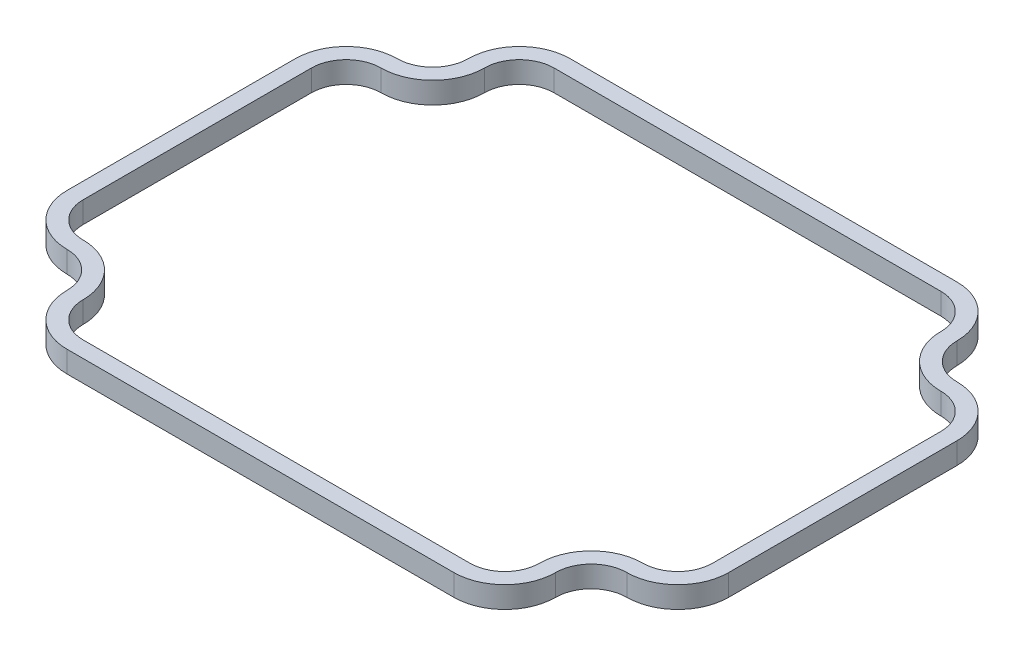
ISO-10303-21;
HEADER;
FILE_DESCRIPTION(('STEP AP214'),'2;1');
FILE_NAME('part.step','',(''),(''),'','','');
FILE_SCHEMA(('AUTOMOTIVE_DESIGN { 1 0 10303 214 1 1 1 1 }'));
ENDSEC;
DATA;
#1=APPLICATION_CONTEXT('core data for automotive mechanical design processes');
#2=APPLICATION_PROTOCOL_DEFINITION('international standard','automotive_design',2000,#1);
#3=PRODUCT_CONTEXT('',#1,'mechanical');
#4=PRODUCT('Part','Part','',(#3));
#5=PRODUCT_RELATED_PRODUCT_CATEGORY('part','',(#4));
#6=PRODUCT_DEFINITION_FORMATION('','',#4);
#7=PRODUCT_DEFINITION_CONTEXT('part definition',#1,'design');
#8=PRODUCT_DEFINITION('design','',#6,#7);
#9=PRODUCT_DEFINITION_SHAPE('','',#8);
#10=(LENGTH_UNIT() NAMED_UNIT(*) SI_UNIT(.MILLI.,.METRE.));
#11=(NAMED_UNIT(*) PLANE_ANGLE_UNIT() SI_UNIT($,.RADIAN.));
#12=(NAMED_UNIT(*) SI_UNIT($,.STERADIAN.) SOLID_ANGLE_UNIT());
#13=UNCERTAINTY_MEASURE_WITH_UNIT(LENGTH_MEASURE(1.E-05),#10,'distance_accuracy_value','');
#14=(GEOMETRIC_REPRESENTATION_CONTEXT(3) GLOBAL_UNCERTAINTY_ASSIGNED_CONTEXT((#13)) GLOBAL_UNIT_ASSIGNED_CONTEXT((#10,
#11,#12)) REPRESENTATION_CONTEXT('',''));
#15=CARTESIAN_POINT('',(0.,0.,0.));
#16=DIRECTION('',(0.,0.,1.));
#17=DIRECTION('',(1.,0.,0.));
#18=AXIS2_PLACEMENT_3D('',#15,#16,#17);
#19=CARTESIAN_POINT('',(-26.4668,0.,10.795));
#20=DIRECTION('',(0.,-1.,0.));
#21=DIRECTION('',(0.,0.,-1.));
#22=AXIS2_PLACEMENT_3D('',#19,#20,#21);
#23=CYLINDRICAL_SURFACE('',#22,4.8133);
#24=DIRECTION('',(0.,-1.,0.));
#25=VECTOR('',#24,1.);
#26=CARTESIAN_POINT('',(-26.4668,0.,15.6083));
#27=LINE('',#26,#25);
#28=CARTESIAN_POINT('',(-26.4668,2.032,15.6083));
#29=VERTEX_POINT('',#28);
#30=CARTESIAN_POINT('',(-26.4668,0.,15.6083));
#31=VERTEX_POINT('',#30);
#32=EDGE_CURVE('E485',#29,#31,#27,.T.);
#33=ORIENTED_EDGE('',*,*,#32,.F.);
#34=CARTESIAN_POINT('',(-26.4668,2.032,10.795));
#35=DIRECTION('',(0.,-1.,0.));
#36=DIRECTION('',(0.,0.,-1.));
#37=AXIS2_PLACEMENT_3D('',#34,#35,#36);
#38=CIRCLE('',#37,4.8133);
#39=CARTESIAN_POINT('',(-31.2801,2.032,10.795));
#40=VERTEX_POINT('',#39);
#41=EDGE_CURVE('E504',#29,#40,#38,.T.);
#42=ORIENTED_EDGE('',*,*,#41,.T.);
#43=DIRECTION('',(0.,-1.,0.));
#44=VECTOR('',#43,1.);
#45=CARTESIAN_POINT('',(-31.2801,0.,10.795));
#46=LINE('',#45,#44);
#47=CARTESIAN_POINT('',(-31.2801,0.,10.795));
#48=VERTEX_POINT('',#47);
#49=EDGE_CURVE('E501',#40,#48,#46,.T.);
#50=ORIENTED_EDGE('',*,*,#49,.T.);
#51=CARTESIAN_POINT('',(-26.4668,0.,10.795));
#52=DIRECTION('',(0.,-1.,0.));
#53=DIRECTION('',(0.,0.,-1.));
#54=AXIS2_PLACEMENT_3D('',#51,#52,#53);
#55=CIRCLE('',#54,4.8133);
#56=EDGE_CURVE('E25',#31,#48,#55,.T.);
#57=ORIENTED_EDGE('',*,*,#56,.F.);
#58=EDGE_LOOP('',(#33,#42,#50,#57));
#59=FACE_BOUND('',#58,.T.);
#60=ADVANCED_FACE('F17',(#59),#23,.T.);
#61=CARTESIAN_POINT('',(-26.4668,0.,10.795));
#62=DIRECTION('',(0.,-1.,0.));
#63=DIRECTION('',(0.,0.,-1.));
#64=AXIS2_PLACEMENT_3D('',#61,#62,#63);
#65=CYLINDRICAL_SURFACE('',#64,3.2893);
#66=DIRECTION('',(0.,1.,0.));
#67=VECTOR('',#66,1.);
#68=CARTESIAN_POINT('',(-26.4668,0.,14.0843));
#69=LINE('',#68,#67);
#70=CARTESIAN_POINT('',(-26.4668,0.,14.0843));
#71=VERTEX_POINT('',#70);
#72=CARTESIAN_POINT('',(-26.4668,2.032,14.0843));
#73=VERTEX_POINT('',#72);
#74=EDGE_CURVE('E482',#71,#73,#69,.T.);
#75=ORIENTED_EDGE('',*,*,#74,.F.);
#76=CARTESIAN_POINT('',(-26.4668,0.,10.795));
#77=DIRECTION('',(0.,-1.,0.));
#78=DIRECTION('',(0.,0.,-1.));
#79=AXIS2_PLACEMENT_3D('',#76,#77,#78);
#80=CIRCLE('',#79,3.2893);
#81=CARTESIAN_POINT('',(-29.7561,0.,10.795));
#82=VERTEX_POINT('',#81);
#83=EDGE_CURVE('E11',#71,#82,#80,.T.);
#84=ORIENTED_EDGE('',*,*,#83,.T.);
#85=DIRECTION('',(0.,1.,0.));
#86=VECTOR('',#85,1.);
#87=CARTESIAN_POINT('',(-29.7561,0.,10.795));
#88=LINE('',#87,#86);
#89=CARTESIAN_POINT('',(-29.7561,2.032,10.795));
#90=VERTEX_POINT('',#89);
#91=EDGE_CURVE('E499',#82,#90,#88,.T.);
#92=ORIENTED_EDGE('',*,*,#91,.T.);
#93=CARTESIAN_POINT('',(-26.4668,2.032,10.795));
#94=DIRECTION('',(0.,-1.,0.));
#95=DIRECTION('',(0.,0.,-1.));
#96=AXIS2_PLACEMENT_3D('',#93,#94,#95);
#97=CIRCLE('',#96,3.2893);
#98=EDGE_CURVE('E247',#73,#90,#97,.T.);
#99=ORIENTED_EDGE('',*,*,#98,.F.);
#100=EDGE_LOOP('',(#75,#84,#92,#99));
#101=FACE_BOUND('',#100,.T.);
#102=ADVANCED_FACE('F576',(#101),#65,.F.);
#103=CARTESIAN_POINT('',(-26.4668,0.,18.9738));
#104=DIRECTION('',(0.,1.,0.));
#105=DIRECTION('',(0.,0.,1.));
#106=AXIS2_PLACEMENT_3D('',#103,#104,#105);
#107=CYLINDRICAL_SURFACE('',#106,3.3655);
#108=DIRECTION('',(0.,-1.,0.));
#109=VECTOR('',#108,1.);
#110=CARTESIAN_POINT('',(-23.1013,0.,18.9738));
#111=LINE('',#110,#109);
#112=CARTESIAN_POINT('',(-23.1013,2.032,18.9738));
#113=VERTEX_POINT('',#112);
#114=CARTESIAN_POINT('',(-23.1013,0.,18.9738));
#115=VERTEX_POINT('',#114);
#116=EDGE_CURVE('E467',#113,#115,#111,.T.);
#117=ORIENTED_EDGE('',*,*,#116,.F.);
#118=CARTESIAN_POINT('',(-26.4668,2.032,18.9738));
#119=DIRECTION('',(0.,1.,0.));
#120=DIRECTION('',(0.,0.,1.));
#121=AXIS2_PLACEMENT_3D('',#118,#119,#120);
#122=CIRCLE('',#121,3.3655);
#123=EDGE_CURVE('E490',#113,#29,#122,.T.);
#124=ORIENTED_EDGE('',*,*,#123,.T.);
#125=ORIENTED_EDGE('',*,*,#32,.T.);
#126=CARTESIAN_POINT('',(-26.4668,0.,18.9738));
#127=DIRECTION('',(0.,1.,0.));
#128=DIRECTION('',(0.,0.,1.));
#129=AXIS2_PLACEMENT_3D('',#126,#127,#128);
#130=CIRCLE('',#129,3.3655);
#131=EDGE_CURVE('E493',#115,#31,#130,.T.);
#132=ORIENTED_EDGE('',*,*,#131,.F.);
#133=EDGE_LOOP('',(#117,#124,#125,#132));
#134=FACE_BOUND('',#133,.T.);
#135=ADVANCED_FACE('F524',(#134),#107,.F.);
#136=CARTESIAN_POINT('',(-26.4668,0.,18.9738));
#137=DIRECTION('',(0.,1.,0.));
#138=DIRECTION('',(0.,0.,1.));
#139=AXIS2_PLACEMENT_3D('',#136,#137,#138);
#140=CYLINDRICAL_SURFACE('',#139,4.8895);
#141=DIRECTION('',(0.,1.,0.));
#142=VECTOR('',#141,1.);
#143=CARTESIAN_POINT('',(-21.5773,0.,18.9738));
#144=LINE('',#143,#142);
#145=CARTESIAN_POINT('',(-21.5773,0.,18.9738));
#146=VERTEX_POINT('',#145);
#147=CARTESIAN_POINT('',(-21.5773,2.032,18.9738));
#148=VERTEX_POINT('',#147);
#149=EDGE_CURVE('E464',#146,#148,#144,.T.);
#150=ORIENTED_EDGE('',*,*,#149,.F.);
#151=CARTESIAN_POINT('',(-26.4668,0.,18.9738));
#152=DIRECTION('',(0.,1.,0.));
#153=DIRECTION('',(0.,0.,1.));
#154=AXIS2_PLACEMENT_3D('',#151,#152,#153);
#155=CIRCLE('',#154,4.8895);
#156=EDGE_CURVE('E496',#146,#71,#155,.T.);
#157=ORIENTED_EDGE('',*,*,#156,.T.);
#158=ORIENTED_EDGE('',*,*,#74,.T.);
#159=CARTESIAN_POINT('',(-26.4668,2.032,18.9738));
#160=DIRECTION('',(0.,1.,0.));
#161=DIRECTION('',(0.,0.,1.));
#162=AXIS2_PLACEMENT_3D('',#159,#160,#161);
#163=CIRCLE('',#162,4.8895);
#164=EDGE_CURVE('E488',#148,#73,#163,.T.);
#165=ORIENTED_EDGE('',*,*,#164,.F.);
#166=EDGE_LOOP('',(#150,#157,#158,#165));
#167=FACE_BOUND('',#166,.T.);
#168=ADVANCED_FACE('F586',(#167),#140,.T.);
#169=CARTESIAN_POINT('',(-18.288,0.,18.9738));
#170=DIRECTION('',(0.,-1.,0.));
#171=DIRECTION('',(0.,0.,-1.));
#172=AXIS2_PLACEMENT_3D('',#169,#170,#171);
#173=CYLINDRICAL_SURFACE('',#172,4.8133);
#174=DIRECTION('',(0.,-1.,0.));
#175=VECTOR('',#174,1.);
#176=CARTESIAN_POINT('',(-18.288,0.,23.7871));
#177=LINE('',#176,#175);
#178=CARTESIAN_POINT('',(-18.288,2.032,23.7871));
#179=VERTEX_POINT('',#178);
#180=CARTESIAN_POINT('',(-18.288,0.,23.7871));
#181=VERTEX_POINT('',#180);
#182=EDGE_CURVE('E449',#179,#181,#177,.T.);
#183=ORIENTED_EDGE('',*,*,#182,.F.);
#184=CARTESIAN_POINT('',(-18.288,2.032,18.9738));
#185=DIRECTION('',(0.,-1.,0.));
#186=DIRECTION('',(0.,0.,-1.));
#187=AXIS2_PLACEMENT_3D('',#184,#185,#186);
#188=CIRCLE('',#187,4.8133);
#189=EDGE_CURVE('E473',#179,#113,#188,.T.);
#190=ORIENTED_EDGE('',*,*,#189,.T.);
#191=ORIENTED_EDGE('',*,*,#116,.T.);
#192=CARTESIAN_POINT('',(-18.288,0.,18.9738));
#193=DIRECTION('',(0.,-1.,0.));
#194=DIRECTION('',(0.,0.,-1.));
#195=AXIS2_PLACEMENT_3D('',#192,#193,#194);
#196=CIRCLE('',#195,4.8133);
#197=EDGE_CURVE('E476',#181,#115,#196,.T.);
#198=ORIENTED_EDGE('',*,*,#197,.F.);
#199=EDGE_LOOP('',(#183,#190,#191,#198));
#200=FACE_BOUND('',#199,.T.);
#201=ADVANCED_FACE('F528',(#200),#173,.T.);
#202=CARTESIAN_POINT('',(-18.288,0.,18.9738));
#203=DIRECTION('',(0.,-1.,0.));
#204=DIRECTION('',(0.,0.,-1.));
#205=AXIS2_PLACEMENT_3D('',#202,#203,#204);
#206=CYLINDRICAL_SURFACE('',#205,3.2893);
#207=DIRECTION('',(0.,1.,0.));
#208=VECTOR('',#207,1.);
#209=CARTESIAN_POINT('',(-18.288,0.,22.2631));
#210=LINE('',#209,#208);
#211=CARTESIAN_POINT('',(-18.288,0.,22.2631));
#212=VERTEX_POINT('',#211);
#213=CARTESIAN_POINT('',(-18.288,2.032,22.2631));
#214=VERTEX_POINT('',#213);
#215=EDGE_CURVE('E446',#212,#214,#210,.T.);
#216=ORIENTED_EDGE('',*,*,#215,.F.);
#217=CARTESIAN_POINT('',(-18.288,0.,18.9738));
#218=DIRECTION('',(0.,-1.,0.));
#219=DIRECTION('',(0.,0.,-1.));
#220=AXIS2_PLACEMENT_3D('',#217,#218,#219);
#221=CIRCLE('',#220,3.2893);
#222=EDGE_CURVE('E479',#212,#146,#221,.T.);
#223=ORIENTED_EDGE('',*,*,#222,.T.);
#224=ORIENTED_EDGE('',*,*,#149,.T.);
#225=CARTESIAN_POINT('',(-18.288,2.032,18.9738));
#226=DIRECTION('',(0.,-1.,0.));
#227=DIRECTION('',(0.,0.,-1.));
#228=AXIS2_PLACEMENT_3D('',#225,#226,#227);
#229=CIRCLE('',#228,3.2893);
#230=EDGE_CURVE('E470',#214,#148,#229,.T.);
#231=ORIENTED_EDGE('',*,*,#230,.F.);
#232=EDGE_LOOP('',(#216,#223,#224,#231));
#233=FACE_BOUND('',#232,.T.);
#234=ADVANCED_FACE('F595',(#233),#206,.F.);
#235=CARTESIAN_POINT('',(18.288,0.,23.7871));
#236=DIRECTION('',(0.,0.,-1.));
#237=DIRECTION('',(-1.,0.,0.));
#238=AXIS2_PLACEMENT_3D('',#235,#236,#237);
#239=PLANE('',#238);
#240=DIRECTION('',(0.,-1.,0.));
#241=VECTOR('',#240,1.);
#242=CARTESIAN_POINT('',(18.288,0.,23.7871));
#243=LINE('',#242,#241);
#244=CARTESIAN_POINT('',(18.288,2.032,23.7871));
#245=VERTEX_POINT('',#244);
#246=CARTESIAN_POINT('',(18.288,0.,23.7871));
#247=VERTEX_POINT('',#246);
#248=EDGE_CURVE('E431',#245,#247,#243,.T.);
#249=ORIENTED_EDGE('',*,*,#248,.F.);
#250=DIRECTION('',(-1.,0.,0.));
#251=VECTOR('',#250,1.);
#252=CARTESIAN_POINT('',(18.288,2.032,23.7871));
#253=LINE('',#252,#251);
#254=EDGE_CURVE('E455',#245,#179,#253,.T.);
#255=ORIENTED_EDGE('',*,*,#254,.T.);
#256=ORIENTED_EDGE('',*,*,#182,.T.);
#257=DIRECTION('',(-1.,0.,0.));
#258=VECTOR('',#257,1.);
#259=CARTESIAN_POINT('',(18.288,0.,23.7871));
#260=LINE('',#259,#258);
#261=EDGE_CURVE('E458',#247,#181,#260,.T.);
#262=ORIENTED_EDGE('',*,*,#261,.F.);
#263=EDGE_LOOP('',(#249,#255,#256,#262));
#264=FACE_BOUND('',#263,.T.);
#265=ADVANCED_FACE('F530',(#264),#239,.F.);
#266=CARTESIAN_POINT('',(18.288,0.,22.2631));
#267=DIRECTION('',(0.,0.,1.));
#268=DIRECTION('',(1.,0.,0.));
#269=AXIS2_PLACEMENT_3D('',#266,#267,#268);
#270=PLANE('',#269);
#271=DIRECTION('',(0.,1.,0.));
#272=VECTOR('',#271,1.);
#273=CARTESIAN_POINT('',(18.288,0.,22.2631));
#274=LINE('',#273,#272);
#275=CARTESIAN_POINT('',(18.288,0.,22.2631));
#276=VERTEX_POINT('',#275);
#277=CARTESIAN_POINT('',(18.288,2.032,22.2631));
#278=VERTEX_POINT('',#277);
#279=EDGE_CURVE('E428',#276,#278,#274,.T.);
#280=ORIENTED_EDGE('',*,*,#279,.F.);
#281=DIRECTION('',(-1.,0.,0.));
#282=VECTOR('',#281,1.);
#283=CARTESIAN_POINT('',(18.288,0.,22.2631));
#284=LINE('',#283,#282);
#285=EDGE_CURVE('E461',#276,#212,#284,.T.);
#286=ORIENTED_EDGE('',*,*,#285,.T.);
#287=ORIENTED_EDGE('',*,*,#215,.T.);
#288=DIRECTION('',(-1.,0.,0.));
#289=VECTOR('',#288,1.);
#290=CARTESIAN_POINT('',(18.288,2.032,22.2631));
#291=LINE('',#290,#289);
#292=EDGE_CURVE('E452',#278,#214,#291,.T.);
#293=ORIENTED_EDGE('',*,*,#292,.F.);
#294=EDGE_LOOP('',(#280,#286,#287,#293));
#295=FACE_BOUND('',#294,.T.);
#296=ADVANCED_FACE('F601',(#295),#270,.F.);
#297=CARTESIAN_POINT('',(18.288,0.,18.9738));
#298=DIRECTION('',(0.,-1.,0.));
#299=DIRECTION('',(0.,0.,-1.));
#300=AXIS2_PLACEMENT_3D('',#297,#298,#299);
#301=CYLINDRICAL_SURFACE('',#300,4.8133);
#302=DIRECTION('',(0.,-1.,0.));
#303=VECTOR('',#302,1.);
#304=CARTESIAN_POINT('',(23.1013,0.,18.9738));
#305=LINE('',#304,#303);
#306=CARTESIAN_POINT('',(23.1013,2.032,18.9738));
#307=VERTEX_POINT('',#306);
#308=CARTESIAN_POINT('',(23.1013,0.,18.9738));
#309=VERTEX_POINT('',#308);
#310=EDGE_CURVE('E413',#307,#309,#305,.T.);
#311=ORIENTED_EDGE('',*,*,#310,.F.);
#312=CARTESIAN_POINT('',(18.288,2.032,18.9738));
#313=DIRECTION('',(0.,-1.,0.));
#314=DIRECTION('',(0.,0.,-1.));
#315=AXIS2_PLACEMENT_3D('',#312,#313,#314);
#316=CIRCLE('',#315,4.8133);
#317=EDGE_CURVE('E437',#307,#245,#316,.T.);
#318=ORIENTED_EDGE('',*,*,#317,.T.);
#319=ORIENTED_EDGE('',*,*,#248,.T.);
#320=CARTESIAN_POINT('',(18.288,0.,18.9738));
#321=DIRECTION('',(0.,-1.,0.));
#322=DIRECTION('',(0.,0.,-1.));
#323=AXIS2_PLACEMENT_3D('',#320,#321,#322);
#324=CIRCLE('',#323,4.8133);
#325=EDGE_CURVE('E440',#309,#247,#324,.T.);
#326=ORIENTED_EDGE('',*,*,#325,.F.);
#327=EDGE_LOOP('',(#311,#318,#319,#326));
#328=FACE_BOUND('',#327,.T.);
#329=ADVANCED_FACE('F533',(#328),#301,.T.);
#330=CARTESIAN_POINT('',(18.288,0.,18.9738));
#331=DIRECTION('',(0.,-1.,0.));
#332=DIRECTION('',(0.,0.,-1.));
#333=AXIS2_PLACEMENT_3D('',#330,#331,#332);
#334=CYLINDRICAL_SURFACE('',#333,3.2893);
#335=DIRECTION('',(0.,1.,0.));
#336=VECTOR('',#335,1.);
#337=CARTESIAN_POINT('',(21.5773,0.,18.9738));
#338=LINE('',#337,#336);
#339=CARTESIAN_POINT('',(21.5773,0.,18.9738));
#340=VERTEX_POINT('',#339);
#341=CARTESIAN_POINT('',(21.5773,2.032,18.9738));
#342=VERTEX_POINT('',#341);
#343=EDGE_CURVE('E410',#340,#342,#338,.T.);
#344=ORIENTED_EDGE('',*,*,#343,.F.);
#345=CARTESIAN_POINT('',(18.288,0.,18.9738));
#346=DIRECTION('',(0.,-1.,0.));
#347=DIRECTION('',(0.,0.,-1.));
#348=AXIS2_PLACEMENT_3D('',#345,#346,#347);
#349=CIRCLE('',#348,3.2893);
#350=EDGE_CURVE('E443',#340,#276,#349,.T.);
#351=ORIENTED_EDGE('',*,*,#350,.T.);
#352=ORIENTED_EDGE('',*,*,#279,.T.);
#353=CARTESIAN_POINT('',(18.288,2.032,18.9738));
#354=DIRECTION('',(0.,-1.,0.));
#355=DIRECTION('',(0.,0.,-1.));
#356=AXIS2_PLACEMENT_3D('',#353,#354,#355);
#357=CIRCLE('',#356,3.2893);
#358=EDGE_CURVE('E434',#342,#278,#357,.T.);
#359=ORIENTED_EDGE('',*,*,#358,.F.);
#360=EDGE_LOOP('',(#344,#351,#352,#359));
#361=FACE_BOUND('',#360,.T.);
#362=ADVANCED_FACE('F607',(#361),#334,.F.);
#363=CARTESIAN_POINT('',(26.4668,0.,18.9738));
#364=DIRECTION('',(0.,1.,0.));
#365=DIRECTION('',(0.,0.,1.));
#366=AXIS2_PLACEMENT_3D('',#363,#364,#365);
#367=CYLINDRICAL_SURFACE('',#366,3.3655);
#368=DIRECTION('',(0.,-1.,0.));
#369=VECTOR('',#368,1.);
#370=CARTESIAN_POINT('',(26.4668,0.,15.6083));
#371=LINE('',#370,#369);
#372=CARTESIAN_POINT('',(26.4668,2.032,15.6083));
#373=VERTEX_POINT('',#372);
#374=CARTESIAN_POINT('',(26.4668,0.,15.6083));
#375=VERTEX_POINT('',#374);
#376=EDGE_CURVE('E395',#373,#375,#371,.T.);
#377=ORIENTED_EDGE('',*,*,#376,.F.);
#378=CARTESIAN_POINT('',(26.4668,2.032,18.9738));
#379=DIRECTION('',(0.,1.,0.));
#380=DIRECTION('',(0.,0.,1.));
#381=AXIS2_PLACEMENT_3D('',#378,#379,#380);
#382=CIRCLE('',#381,3.3655);
#383=EDGE_CURVE('E419',#373,#307,#382,.T.);
#384=ORIENTED_EDGE('',*,*,#383,.T.);
#385=ORIENTED_EDGE('',*,*,#310,.T.);
#386=CARTESIAN_POINT('',(26.4668,0.,18.9738));
#387=DIRECTION('',(0.,1.,0.));
#388=DIRECTION('',(0.,0.,1.));
#389=AXIS2_PLACEMENT_3D('',#386,#387,#388);
#390=CIRCLE('',#389,3.3655);
#391=EDGE_CURVE('E422',#375,#309,#390,.T.);
#392=ORIENTED_EDGE('',*,*,#391,.F.);
#393=EDGE_LOOP('',(#377,#384,#385,#392));
#394=FACE_BOUND('',#393,.T.);
#395=ADVANCED_FACE('F537',(#394),#367,.F.);
#396=CARTESIAN_POINT('',(26.4668,0.,18.9738));
#397=DIRECTION('',(0.,1.,0.));
#398=DIRECTION('',(0.,0.,1.));
#399=AXIS2_PLACEMENT_3D('',#396,#397,#398);
#400=CYLINDRICAL_SURFACE('',#399,4.8895);
#401=DIRECTION('',(0.,1.,0.));
#402=VECTOR('',#401,1.);
#403=CARTESIAN_POINT('',(26.4668,0.,14.0843));
#404=LINE('',#403,#402);
#405=CARTESIAN_POINT('',(26.4668,0.,14.0843));
#406=VERTEX_POINT('',#405);
#407=CARTESIAN_POINT('',(26.4668,2.032,14.0843));
#408=VERTEX_POINT('',#407);
#409=EDGE_CURVE('E392',#406,#408,#404,.T.);
#410=ORIENTED_EDGE('',*,*,#409,.F.);
#411=CARTESIAN_POINT('',(26.4668,0.,18.9738));
#412=DIRECTION('',(0.,1.,0.));
#413=DIRECTION('',(0.,0.,1.));
#414=AXIS2_PLACEMENT_3D('',#411,#412,#413);
#415=CIRCLE('',#414,4.8895);
#416=EDGE_CURVE('E425',#406,#340,#415,.T.);
#417=ORIENTED_EDGE('',*,*,#416,.T.);
#418=ORIENTED_EDGE('',*,*,#343,.T.);
#419=CARTESIAN_POINT('',(26.4668,2.032,18.9738));
#420=DIRECTION('',(0.,1.,0.));
#421=DIRECTION('',(0.,0.,1.));
#422=AXIS2_PLACEMENT_3D('',#419,#420,#421);
#423=CIRCLE('',#422,4.8895);
#424=EDGE_CURVE('E416',#408,#342,#423,.T.);
#425=ORIENTED_EDGE('',*,*,#424,.F.);
#426=EDGE_LOOP('',(#410,#417,#418,#425));
#427=FACE_BOUND('',#426,.T.);
#428=ADVANCED_FACE('F613',(#427),#400,.T.);
#429=CARTESIAN_POINT('',(26.4668,0.,10.795));
#430=DIRECTION('',(0.,-1.,0.));
#431=DIRECTION('',(0.,0.,-1.));
#432=AXIS2_PLACEMENT_3D('',#429,#430,#431);
#433=CYLINDRICAL_SURFACE('',#432,4.8133);
#434=DIRECTION('',(0.,-1.,0.));
#435=VECTOR('',#434,1.);
#436=CARTESIAN_POINT('',(31.2801,0.,10.795));
#437=LINE('',#436,#435);
#438=CARTESIAN_POINT('',(31.2801,2.032,10.795));
#439=VERTEX_POINT('',#438);
#440=CARTESIAN_POINT('',(31.2801,0.,10.795));
#441=VERTEX_POINT('',#440);
#442=EDGE_CURVE('E377',#439,#441,#437,.T.);
#443=ORIENTED_EDGE('',*,*,#442,.F.);
#444=CARTESIAN_POINT('',(26.4668,2.032,10.795));
#445=DIRECTION('',(0.,-1.,0.));
#446=DIRECTION('',(0.,0.,-1.));
#447=AXIS2_PLACEMENT_3D('',#444,#445,#446);
#448=CIRCLE('',#447,4.8133);
#449=EDGE_CURVE('E401',#439,#373,#448,.T.);
#450=ORIENTED_EDGE('',*,*,#449,.T.);
#451=ORIENTED_EDGE('',*,*,#376,.T.);
#452=CARTESIAN_POINT('',(26.4668,0.,10.795));
#453=DIRECTION('',(0.,-1.,0.));
#454=DIRECTION('',(0.,0.,-1.));
#455=AXIS2_PLACEMENT_3D('',#452,#453,#454);
#456=CIRCLE('',#455,4.8133);
#457=EDGE_CURVE('E404',#441,#375,#456,.T.);
#458=ORIENTED_EDGE('',*,*,#457,.F.);
#459=EDGE_LOOP('',(#443,#450,#451,#458));
#460=FACE_BOUND('',#459,.T.);
#461=ADVANCED_FACE('F539',(#460),#433,.T.);
#462=CARTESIAN_POINT('',(26.4668,0.,10.795));
#463=DIRECTION('',(0.,-1.,0.));
#464=DIRECTION('',(0.,0.,-1.));
#465=AXIS2_PLACEMENT_3D('',#462,#463,#464);
#466=CYLINDRICAL_SURFACE('',#465,3.2893);
#467=DIRECTION('',(0.,1.,0.));
#468=VECTOR('',#467,1.);
#469=CARTESIAN_POINT('',(29.7561,0.,10.795));
#470=LINE('',#469,#468);
#471=CARTESIAN_POINT('',(29.7561,0.,10.795));
#472=VERTEX_POINT('',#471);
#473=CARTESIAN_POINT('',(29.7561,2.032,10.795));
#474=VERTEX_POINT('',#473);
#475=EDGE_CURVE('E374',#472,#474,#470,.T.);
#476=ORIENTED_EDGE('',*,*,#475,.F.);
#477=CARTESIAN_POINT('',(26.4668,0.,10.795));
#478=DIRECTION('',(0.,-1.,0.));
#479=DIRECTION('',(0.,0.,-1.));
#480=AXIS2_PLACEMENT_3D('',#477,#478,#479);
#481=CIRCLE('',#480,3.2893);
#482=EDGE_CURVE('E407',#472,#406,#481,.T.);
#483=ORIENTED_EDGE('',*,*,#482,.T.);
#484=ORIENTED_EDGE('',*,*,#409,.T.);
#485=CARTESIAN_POINT('',(26.4668,2.032,10.795));
#486=DIRECTION('',(0.,-1.,0.));
#487=DIRECTION('',(0.,0.,-1.));
#488=AXIS2_PLACEMENT_3D('',#485,#486,#487);
#489=CIRCLE('',#488,3.2893);
#490=EDGE_CURVE('E398',#474,#408,#489,.T.);
#491=ORIENTED_EDGE('',*,*,#490,.F.);
#492=EDGE_LOOP('',(#476,#483,#484,#491));
#493=FACE_BOUND('',#492,.T.);
#494=ADVANCED_FACE('F619',(#493),#466,.F.);
#495=CARTESIAN_POINT('',(31.2801,0.,-10.795));
#496=DIRECTION('',(-1.,0.,0.));
#497=DIRECTION('',(0.,0.,1.));
#498=AXIS2_PLACEMENT_3D('',#495,#496,#497);
#499=PLANE('',#498);
#500=DIRECTION('',(0.,-1.,0.));
#501=VECTOR('',#500,1.);
#502=CARTESIAN_POINT('',(31.2801,0.,-10.795));
#503=LINE('',#502,#501);
#504=CARTESIAN_POINT('',(31.2801,2.032,-10.795));
#505=VERTEX_POINT('',#504);
#506=CARTESIAN_POINT('',(31.2801,0.,-10.795));
#507=VERTEX_POINT('',#506);
#508=EDGE_CURVE('E359',#505,#507,#503,.T.);
#509=ORIENTED_EDGE('',*,*,#508,.F.);
#510=DIRECTION('',(0.,0.,1.));
#511=VECTOR('',#510,1.);
#512=CARTESIAN_POINT('',(31.2801,2.032,-10.795));
#513=LINE('',#512,#511);
#514=EDGE_CURVE('E383',#505,#439,#513,.T.);
#515=ORIENTED_EDGE('',*,*,#514,.T.);
#516=ORIENTED_EDGE('',*,*,#442,.T.);
#517=DIRECTION('',(0.,0.,1.));
#518=VECTOR('',#517,1.);
#519=CARTESIAN_POINT('',(31.2801,0.,-10.795));
#520=LINE('',#519,#518);
#521=EDGE_CURVE('E386',#507,#441,#520,.T.);
#522=ORIENTED_EDGE('',*,*,#521,.F.);
#523=EDGE_LOOP('',(#509,#515,#516,#522));
#524=FACE_BOUND('',#523,.T.);
#525=ADVANCED_FACE('F542',(#524),#499,.F.);
#526=CARTESIAN_POINT('',(29.7561,0.,-10.795));
#527=DIRECTION('',(1.,0.,0.));
#528=DIRECTION('',(0.,0.,-1.));
#529=AXIS2_PLACEMENT_3D('',#526,#527,#528);
#530=PLANE('',#529);
#531=DIRECTION('',(0.,1.,0.));
#532=VECTOR('',#531,1.);
#533=CARTESIAN_POINT('',(29.7561,0.,-10.795));
#534=LINE('',#533,#532);
#535=CARTESIAN_POINT('',(29.7561,0.,-10.795));
#536=VERTEX_POINT('',#535);
#537=CARTESIAN_POINT('',(29.7561,2.032,-10.795));
#538=VERTEX_POINT('',#537);
#539=EDGE_CURVE('E356',#536,#538,#534,.T.);
#540=ORIENTED_EDGE('',*,*,#539,.F.);
#541=DIRECTION('',(0.,0.,1.));
#542=VECTOR('',#541,1.);
#543=CARTESIAN_POINT('',(29.7561,0.,-10.795));
#544=LINE('',#543,#542);
#545=EDGE_CURVE('E389',#536,#472,#544,.T.);
#546=ORIENTED_EDGE('',*,*,#545,.T.);
#547=ORIENTED_EDGE('',*,*,#475,.T.);
#548=DIRECTION('',(0.,0.,1.));
#549=VECTOR('',#548,1.);
#550=CARTESIAN_POINT('',(29.7561,2.032,-10.795));
#551=LINE('',#550,#549);
#552=EDGE_CURVE('E380',#538,#474,#551,.T.);
#553=ORIENTED_EDGE('',*,*,#552,.F.);
#554=EDGE_LOOP('',(#540,#546,#547,#553));
#555=FACE_BOUND('',#554,.T.);
#556=ADVANCED_FACE('F625',(#555),#530,.F.);
#557=CARTESIAN_POINT('',(26.4668,0.,-10.795));
#558=DIRECTION('',(0.,-1.,0.));
#559=DIRECTION('',(0.,0.,-1.));
#560=AXIS2_PLACEMENT_3D('',#557,#558,#559);
#561=CYLINDRICAL_SURFACE('',#560,4.8133);
#562=DIRECTION('',(0.,-1.,0.));
#563=VECTOR('',#562,1.);
#564=CARTESIAN_POINT('',(26.4668,0.,-15.6083));
#565=LINE('',#564,#563);
#566=CARTESIAN_POINT('',(26.4668,2.032,-15.6083));
#567=VERTEX_POINT('',#566);
#568=CARTESIAN_POINT('',(26.4668,0.,-15.6083));
#569=VERTEX_POINT('',#568);
#570=EDGE_CURVE('E341',#567,#569,#565,.T.);
#571=ORIENTED_EDGE('',*,*,#570,.F.);
#572=CARTESIAN_POINT('',(26.4668,2.032,-10.795));
#573=DIRECTION('',(0.,-1.,0.));
#574=DIRECTION('',(0.,0.,-1.));
#575=AXIS2_PLACEMENT_3D('',#572,#573,#574);
#576=CIRCLE('',#575,4.8133);
#577=EDGE_CURVE('E365',#567,#505,#576,.T.);
#578=ORIENTED_EDGE('',*,*,#577,.T.);
#579=ORIENTED_EDGE('',*,*,#508,.T.);
#580=CARTESIAN_POINT('',(26.4668,0.,-10.795));
#581=DIRECTION('',(0.,-1.,0.));
#582=DIRECTION('',(0.,0.,-1.));
#583=AXIS2_PLACEMENT_3D('',#580,#581,#582);
#584=CIRCLE('',#583,4.8133);
#585=EDGE_CURVE('E368',#569,#507,#584,.T.);
#586=ORIENTED_EDGE('',*,*,#585,.F.);
#587=EDGE_LOOP('',(#571,#578,#579,#586));
#588=FACE_BOUND('',#587,.T.);
#589=ADVANCED_FACE('F546',(#588),#561,.T.);
#590=CARTESIAN_POINT('',(26.4668,0.,-10.795));
#591=DIRECTION('',(0.,-1.,0.));
#592=DIRECTION('',(0.,0.,-1.));
#593=AXIS2_PLACEMENT_3D('',#590,#591,#592);
#594=CYLINDRICAL_SURFACE('',#593,3.2893);
#595=DIRECTION('',(0.,1.,0.));
#596=VECTOR('',#595,1.);
#597=CARTESIAN_POINT('',(26.4668,0.,-14.0843));
#598=LINE('',#597,#596);
#599=CARTESIAN_POINT('',(26.4668,0.,-14.0843));
#600=VERTEX_POINT('',#599);
#601=CARTESIAN_POINT('',(26.4668,2.032,-14.0843));
#602=VERTEX_POINT('',#601);
#603=EDGE_CURVE('E338',#600,#602,#598,.T.);
#604=ORIENTED_EDGE('',*,*,#603,.F.);
#605=CARTESIAN_POINT('',(26.4668,0.,-10.795));
#606=DIRECTION('',(0.,-1.,0.));
#607=DIRECTION('',(0.,0.,-1.));
#608=AXIS2_PLACEMENT_3D('',#605,#606,#607);
#609=CIRCLE('',#608,3.2893);
#610=EDGE_CURVE('E371',#600,#536,#609,.T.);
#611=ORIENTED_EDGE('',*,*,#610,.T.);
#612=ORIENTED_EDGE('',*,*,#539,.T.);
#613=CARTESIAN_POINT('',(26.4668,2.032,-10.795));
#614=DIRECTION('',(0.,-1.,0.));
#615=DIRECTION('',(0.,0.,-1.));
#616=AXIS2_PLACEMENT_3D('',#613,#614,#615);
#617=CIRCLE('',#616,3.2893);
#618=EDGE_CURVE('E362',#602,#538,#617,.T.);
#619=ORIENTED_EDGE('',*,*,#618,.F.);
#620=EDGE_LOOP('',(#604,#611,#612,#619));
#621=FACE_BOUND('',#620,.T.);
#622=ADVANCED_FACE('F631',(#621),#594,.F.);
#623=CARTESIAN_POINT('',(26.4668,0.,-18.9738));
#624=DIRECTION('',(0.,1.,0.));
#625=DIRECTION('',(0.,0.,1.));
#626=AXIS2_PLACEMENT_3D('',#623,#624,#625);
#627=CYLINDRICAL_SURFACE('',#626,3.3655);
#628=DIRECTION('',(0.,-1.,0.));
#629=VECTOR('',#628,1.);
#630=CARTESIAN_POINT('',(23.1013,0.,-18.9738));
#631=LINE('',#630,#629);
#632=CARTESIAN_POINT('',(23.1013,2.032,-18.9738));
#633=VERTEX_POINT('',#632);
#634=CARTESIAN_POINT('',(23.1013,0.,-18.9738));
#635=VERTEX_POINT('',#634);
#636=EDGE_CURVE('E323',#633,#635,#631,.T.);
#637=ORIENTED_EDGE('',*,*,#636,.F.);
#638=CARTESIAN_POINT('',(26.4668,2.032,-18.9738));
#639=DIRECTION('',(0.,1.,0.));
#640=DIRECTION('',(0.,0.,1.));
#641=AXIS2_PLACEMENT_3D('',#638,#639,#640);
#642=CIRCLE('',#641,3.3655);
#643=EDGE_CURVE('E347',#633,#567,#642,.T.);
#644=ORIENTED_EDGE('',*,*,#643,.T.);
#645=ORIENTED_EDGE('',*,*,#570,.T.);
#646=CARTESIAN_POINT('',(26.4668,0.,-18.9738));
#647=DIRECTION('',(0.,1.,0.));
#648=DIRECTION('',(0.,0.,1.));
#649=AXIS2_PLACEMENT_3D('',#646,#647,#648);
#650=CIRCLE('',#649,3.3655);
#651=EDGE_CURVE('E350',#635,#569,#650,.T.);
#652=ORIENTED_EDGE('',*,*,#651,.F.);
#653=EDGE_LOOP('',(#637,#644,#645,#652));
#654=FACE_BOUND('',#653,.T.);
#655=ADVANCED_FACE('F548',(#654),#627,.F.);
#656=CARTESIAN_POINT('',(26.4668,0.,-18.9738));
#657=DIRECTION('',(0.,1.,0.));
#658=DIRECTION('',(0.,0.,1.));
#659=AXIS2_PLACEMENT_3D('',#656,#657,#658);
#660=CYLINDRICAL_SURFACE('',#659,4.8895);
#661=DIRECTION('',(0.,1.,0.));
#662=VECTOR('',#661,1.);
#663=CARTESIAN_POINT('',(21.5773,0.,-18.9738));
#664=LINE('',#663,#662);
#665=CARTESIAN_POINT('',(21.5773,0.,-18.9738));
#666=VERTEX_POINT('',#665);
#667=CARTESIAN_POINT('',(21.5773,2.032,-18.9738));
#668=VERTEX_POINT('',#667);
#669=EDGE_CURVE('E320',#666,#668,#664,.T.);
#670=ORIENTED_EDGE('',*,*,#669,.F.);
#671=CARTESIAN_POINT('',(26.4668,0.,-18.9738));
#672=DIRECTION('',(0.,1.,0.));
#673=DIRECTION('',(0.,0.,1.));
#674=AXIS2_PLACEMENT_3D('',#671,#672,#673);
#675=CIRCLE('',#674,4.8895);
#676=EDGE_CURVE('E353',#666,#600,#675,.T.);
#677=ORIENTED_EDGE('',*,*,#676,.T.);
#678=ORIENTED_EDGE('',*,*,#603,.T.);
#679=CARTESIAN_POINT('',(26.4668,2.032,-18.9738));
#680=DIRECTION('',(0.,1.,0.));
#681=DIRECTION('',(0.,0.,1.));
#682=AXIS2_PLACEMENT_3D('',#679,#680,#681);
#683=CIRCLE('',#682,4.8895);
#684=EDGE_CURVE('E344',#668,#602,#683,.T.);
#685=ORIENTED_EDGE('',*,*,#684,.F.);
#686=EDGE_LOOP('',(#670,#677,#678,#685));
#687=FACE_BOUND('',#686,.T.);
#688=ADVANCED_FACE('F637',(#687),#660,.T.);
#689=CARTESIAN_POINT('',(18.288,0.,-18.9738));
#690=DIRECTION('',(0.,-1.,0.));
#691=DIRECTION('',(0.,0.,-1.));
#692=AXIS2_PLACEMENT_3D('',#689,#690,#691);
#693=CYLINDRICAL_SURFACE('',#692,4.8133);
#694=DIRECTION('',(0.,-1.,0.));
#695=VECTOR('',#694,1.);
#696=CARTESIAN_POINT('',(18.288,0.,-23.7871));
#697=LINE('',#696,#695);
#698=CARTESIAN_POINT('',(18.288,2.032,-23.7871));
#699=VERTEX_POINT('',#698);
#700=CARTESIAN_POINT('',(18.288,0.,-23.7871));
#701=VERTEX_POINT('',#700);
#702=EDGE_CURVE('E305',#699,#701,#697,.T.);
#703=ORIENTED_EDGE('',*,*,#702,.F.);
#704=CARTESIAN_POINT('',(18.288,2.032,-18.9738));
#705=DIRECTION('',(0.,-1.,0.));
#706=DIRECTION('',(0.,0.,-1.));
#707=AXIS2_PLACEMENT_3D('',#704,#705,#706);
#708=CIRCLE('',#707,4.8133);
#709=EDGE_CURVE('E329',#699,#633,#708,.T.);
#710=ORIENTED_EDGE('',*,*,#709,.T.);
#711=ORIENTED_EDGE('',*,*,#636,.T.);
#712=CARTESIAN_POINT('',(18.288,0.,-18.9738));
#713=DIRECTION('',(0.,-1.,0.));
#714=DIRECTION('',(0.,0.,-1.));
#715=AXIS2_PLACEMENT_3D('',#712,#713,#714);
#716=CIRCLE('',#715,4.8133);
#717=EDGE_CURVE('E332',#701,#635,#716,.T.);
#718=ORIENTED_EDGE('',*,*,#717,.F.);
#719=EDGE_LOOP('',(#703,#710,#711,#718));
#720=FACE_BOUND('',#719,.T.);
#721=ADVANCED_FACE('F551',(#720),#693,.T.);
#722=CARTESIAN_POINT('',(18.288,0.,-18.9738));
#723=DIRECTION('',(0.,-1.,0.));
#724=DIRECTION('',(0.,0.,-1.));
#725=AXIS2_PLACEMENT_3D('',#722,#723,#724);
#726=CYLINDRICAL_SURFACE('',#725,3.2893);
#727=DIRECTION('',(0.,1.,0.));
#728=VECTOR('',#727,1.);
#729=CARTESIAN_POINT('',(18.288,0.,-22.2631));
#730=LINE('',#729,#728);
#731=CARTESIAN_POINT('',(18.288,0.,-22.2631));
#732=VERTEX_POINT('',#731);
#733=CARTESIAN_POINT('',(18.288,2.032,-22.2631));
#734=VERTEX_POINT('',#733);
#735=EDGE_CURVE('E302',#732,#734,#730,.T.);
#736=ORIENTED_EDGE('',*,*,#735,.F.);
#737=CARTESIAN_POINT('',(18.288,0.,-18.9738));
#738=DIRECTION('',(0.,-1.,0.));
#739=DIRECTION('',(0.,0.,-1.));
#740=AXIS2_PLACEMENT_3D('',#737,#738,#739);
#741=CIRCLE('',#740,3.2893);
#742=EDGE_CURVE('E335',#732,#666,#741,.T.);
#743=ORIENTED_EDGE('',*,*,#742,.T.);
#744=ORIENTED_EDGE('',*,*,#669,.T.);
#745=CARTESIAN_POINT('',(18.288,2.032,-18.9738));
#746=DIRECTION('',(0.,-1.,0.));
#747=DIRECTION('',(0.,0.,-1.));
#748=AXIS2_PLACEMENT_3D('',#745,#746,#747);
#749=CIRCLE('',#748,3.2893);
#750=EDGE_CURVE('E326',#734,#668,#749,.T.);
#751=ORIENTED_EDGE('',*,*,#750,.F.);
#752=EDGE_LOOP('',(#736,#743,#744,#751));
#753=FACE_BOUND('',#752,.T.);
#754=ADVANCED_FACE('F643',(#753),#726,.F.);
#755=CARTESIAN_POINT('',(-18.288,0.,-23.7871));
#756=DIRECTION('',(0.,0.,1.));
#757=DIRECTION('',(1.,0.,0.));
#758=AXIS2_PLACEMENT_3D('',#755,#756,#757);
#759=PLANE('',#758);
#760=DIRECTION('',(0.,-1.,0.));
#761=VECTOR('',#760,1.);
#762=CARTESIAN_POINT('',(-18.288,0.,-23.7871));
#763=LINE('',#762,#761);
#764=CARTESIAN_POINT('',(-18.288,2.032,-23.7871));
#765=VERTEX_POINT('',#764);
#766=CARTESIAN_POINT('',(-18.288,0.,-23.7871));
#767=VERTEX_POINT('',#766);
#768=EDGE_CURVE('E287',#765,#767,#763,.T.);
#769=ORIENTED_EDGE('',*,*,#768,.F.);
#770=DIRECTION('',(1.,0.,0.));
#771=VECTOR('',#770,1.);
#772=CARTESIAN_POINT('',(-18.288,2.032,-23.7871));
#773=LINE('',#772,#771);
#774=EDGE_CURVE('E311',#765,#699,#773,.T.);
#775=ORIENTED_EDGE('',*,*,#774,.T.);
#776=ORIENTED_EDGE('',*,*,#702,.T.);
#777=DIRECTION('',(1.,0.,0.));
#778=VECTOR('',#777,1.);
#779=CARTESIAN_POINT('',(-18.288,0.,-23.7871));
#780=LINE('',#779,#778);
#781=EDGE_CURVE('E314',#767,#701,#780,.T.);
#782=ORIENTED_EDGE('',*,*,#781,.F.);
#783=EDGE_LOOP('',(#769,#775,#776,#782));
#784=FACE_BOUND('',#783,.T.);
#785=ADVANCED_FACE('F555',(#784),#759,.F.);
#786=CARTESIAN_POINT('',(-18.288,0.,-22.2631));
#787=DIRECTION('',(0.,0.,-1.));
#788=DIRECTION('',(-1.,0.,0.));
#789=AXIS2_PLACEMENT_3D('',#786,#787,#788);
#790=PLANE('',#789);
#791=DIRECTION('',(0.,1.,0.));
#792=VECTOR('',#791,1.);
#793=CARTESIAN_POINT('',(-18.288,0.,-22.2631));
#794=LINE('',#793,#792);
#795=CARTESIAN_POINT('',(-18.288,0.,-22.2631));
#796=VERTEX_POINT('',#795);
#797=CARTESIAN_POINT('',(-18.288,2.032,-22.2631));
#798=VERTEX_POINT('',#797);
#799=EDGE_CURVE('E284',#796,#798,#794,.T.);
#800=ORIENTED_EDGE('',*,*,#799,.F.);
#801=DIRECTION('',(1.,0.,0.));
#802=VECTOR('',#801,1.);
#803=CARTESIAN_POINT('',(-18.288,0.,-22.2631));
#804=LINE('',#803,#802);
#805=EDGE_CURVE('E317',#796,#732,#804,.T.);
#806=ORIENTED_EDGE('',*,*,#805,.T.);
#807=ORIENTED_EDGE('',*,*,#735,.T.);
#808=DIRECTION('',(1.,0.,0.));
#809=VECTOR('',#808,1.);
#810=CARTESIAN_POINT('',(-18.288,2.032,-22.2631));
#811=LINE('',#810,#809);
#812=EDGE_CURVE('E308',#798,#734,#811,.T.);
#813=ORIENTED_EDGE('',*,*,#812,.F.);
#814=EDGE_LOOP('',(#800,#806,#807,#813));
#815=FACE_BOUND('',#814,.T.);
#816=ADVANCED_FACE('F649',(#815),#790,.F.);
#817=CARTESIAN_POINT('',(-18.288,0.,-18.9738));
#818=DIRECTION('',(0.,-1.,0.));
#819=DIRECTION('',(0.,0.,-1.));
#820=AXIS2_PLACEMENT_3D('',#817,#818,#819);
#821=CYLINDRICAL_SURFACE('',#820,4.8133);
#822=DIRECTION('',(0.,-1.,0.));
#823=VECTOR('',#822,1.);
#824=CARTESIAN_POINT('',(-23.1013,0.,-18.9738));
#825=LINE('',#824,#823);
#826=CARTESIAN_POINT('',(-23.1013,2.032,-18.9738));
#827=VERTEX_POINT('',#826);
#828=CARTESIAN_POINT('',(-23.1013,0.,-18.9738));
#829=VERTEX_POINT('',#828);
#830=EDGE_CURVE('E270',#827,#829,#825,.T.);
#831=ORIENTED_EDGE('',*,*,#830,.F.);
#832=CARTESIAN_POINT('',(-18.288,2.032,-18.9738));
#833=DIRECTION('',(0.,-1.,0.));
#834=DIRECTION('',(0.,0.,-1.));
#835=AXIS2_PLACEMENT_3D('',#832,#833,#834);
#836=CIRCLE('',#835,4.8133);
#837=EDGE_CURVE('E293',#827,#765,#836,.T.);
#838=ORIENTED_EDGE('',*,*,#837,.T.);
#839=ORIENTED_EDGE('',*,*,#768,.T.);
#840=CARTESIAN_POINT('',(-18.288,0.,-18.9738));
#841=DIRECTION('',(0.,-1.,0.));
#842=DIRECTION('',(0.,0.,-1.));
#843=AXIS2_PLACEMENT_3D('',#840,#841,#842);
#844=CIRCLE('',#843,4.8133);
#845=EDGE_CURVE('E296',#829,#767,#844,.T.);
#846=ORIENTED_EDGE('',*,*,#845,.F.);
#847=EDGE_LOOP('',(#831,#838,#839,#846));
#848=FACE_BOUND('',#847,.T.);
#849=ADVANCED_FACE('F557',(#848),#821,.T.);
#850=CARTESIAN_POINT('',(-18.288,0.,-18.9738));
#851=DIRECTION('',(0.,-1.,0.));
#852=DIRECTION('',(0.,0.,-1.));
#853=AXIS2_PLACEMENT_3D('',#850,#851,#852);
#854=CYLINDRICAL_SURFACE('',#853,3.2893);
#855=DIRECTION('',(0.,1.,0.));
#856=VECTOR('',#855,1.);
#857=CARTESIAN_POINT('',(-21.5773,0.,-18.9738));
#858=LINE('',#857,#856);
#859=CARTESIAN_POINT('',(-21.5773,0.,-18.9738));
#860=VERTEX_POINT('',#859);
#861=CARTESIAN_POINT('',(-21.5773,2.032,-18.9738));
#862=VERTEX_POINT('',#861);
#863=EDGE_CURVE('E267',#860,#862,#858,.T.);
#864=ORIENTED_EDGE('',*,*,#863,.F.);
#865=CARTESIAN_POINT('',(-18.288,0.,-18.9738));
#866=DIRECTION('',(0.,-1.,0.));
#867=DIRECTION('',(0.,0.,-1.));
#868=AXIS2_PLACEMENT_3D('',#865,#866,#867);
#869=CIRCLE('',#868,3.2893);
#870=EDGE_CURVE('E299',#860,#796,#869,.T.);
#871=ORIENTED_EDGE('',*,*,#870,.T.);
#872=ORIENTED_EDGE('',*,*,#799,.T.);
#873=CARTESIAN_POINT('',(-18.288,2.032,-18.9738));
#874=DIRECTION('',(0.,-1.,0.));
#875=DIRECTION('',(0.,0.,-1.));
#876=AXIS2_PLACEMENT_3D('',#873,#874,#875);
#877=CIRCLE('',#876,3.2893);
#878=EDGE_CURVE('E290',#862,#798,#877,.T.);
#879=ORIENTED_EDGE('',*,*,#878,.F.);
#880=EDGE_LOOP('',(#864,#871,#872,#879));
#881=FACE_BOUND('',#880,.T.);
#882=ADVANCED_FACE('F655',(#881),#854,.F.);
#883=CARTESIAN_POINT('',(-26.4668,0.,-18.9738));
#884=DIRECTION('',(0.,1.,0.));
#885=DIRECTION('',(0.,0.,1.));
#886=AXIS2_PLACEMENT_3D('',#883,#884,#885);
#887=CYLINDRICAL_SURFACE('',#886,3.3655);
#888=DIRECTION('',(0.,-1.,0.));
#889=VECTOR('',#888,1.);
#890=CARTESIAN_POINT('',(-26.4668,0.,-15.6083));
#891=LINE('',#890,#889);
#892=CARTESIAN_POINT('',(-26.4668,2.032,-15.6083));
#893=VERTEX_POINT('',#892);
#894=CARTESIAN_POINT('',(-26.4668,0.,-15.6083));
#895=VERTEX_POINT('',#894);
#896=EDGE_CURVE('E241',#893,#895,#891,.T.);
#897=ORIENTED_EDGE('',*,*,#896,.F.);
#898=CARTESIAN_POINT('',(-26.4668,2.032,-18.9738));
#899=DIRECTION('',(0.,1.,0.));
#900=DIRECTION('',(0.,0.,1.));
#901=AXIS2_PLACEMENT_3D('',#898,#899,#900);
#902=CIRCLE('',#901,3.3655);
#903=EDGE_CURVE('E275',#893,#827,#902,.T.);
#904=ORIENTED_EDGE('',*,*,#903,.T.);
#905=ORIENTED_EDGE('',*,*,#830,.T.);
#906=CARTESIAN_POINT('',(-26.4668,0.,-18.9738));
#907=DIRECTION('',(0.,1.,0.));
#908=DIRECTION('',(0.,0.,1.));
#909=AXIS2_PLACEMENT_3D('',#906,#907,#908);
#910=CIRCLE('',#909,3.3655);
#911=EDGE_CURVE('E278',#895,#829,#910,.T.);
#912=ORIENTED_EDGE('',*,*,#911,.F.);
#913=EDGE_LOOP('',(#897,#904,#905,#912));
#914=FACE_BOUND('',#913,.T.);
#915=ADVANCED_FACE('F560',(#914),#887,.F.);
#916=CARTESIAN_POINT('',(-26.4668,0.,-18.9738));
#917=DIRECTION('',(0.,1.,0.));
#918=DIRECTION('',(0.,0.,1.));
#919=AXIS2_PLACEMENT_3D('',#916,#917,#918);
#920=CYLINDRICAL_SURFACE('',#919,4.8895);
#921=DIRECTION('',(0.,1.,0.));
#922=VECTOR('',#921,1.);
#923=CARTESIAN_POINT('',(-26.4668,0.,-14.0843));
#924=LINE('',#923,#922);
#925=CARTESIAN_POINT('',(-26.4668,0.,-14.0843));
#926=VERTEX_POINT('',#925);
#927=CARTESIAN_POINT('',(-26.4668,2.032,-14.0843));
#928=VERTEX_POINT('',#927);
#929=EDGE_CURVE('E237',#926,#928,#924,.T.);
#930=ORIENTED_EDGE('',*,*,#929,.F.);
#931=CARTESIAN_POINT('',(-26.4668,0.,-18.9738));
#932=DIRECTION('',(0.,1.,0.));
#933=DIRECTION('',(0.,0.,1.));
#934=AXIS2_PLACEMENT_3D('',#931,#932,#933);
#935=CIRCLE('',#934,4.8895);
#936=EDGE_CURVE('E281',#926,#860,#935,.T.);
#937=ORIENTED_EDGE('',*,*,#936,.T.);
#938=ORIENTED_EDGE('',*,*,#863,.T.);
#939=CARTESIAN_POINT('',(-26.4668,2.032,-18.9738));
#940=DIRECTION('',(0.,1.,0.));
#941=DIRECTION('',(0.,0.,1.));
#942=AXIS2_PLACEMENT_3D('',#939,#940,#941);
#943=CIRCLE('',#942,4.8895);
#944=EDGE_CURVE('E273',#928,#862,#943,.T.);
#945=ORIENTED_EDGE('',*,*,#944,.F.);
#946=EDGE_LOOP('',(#930,#937,#938,#945));
#947=FACE_BOUND('',#946,.T.);
#948=ADVANCED_FACE('F661',(#947),#920,.T.);
#949=CARTESIAN_POINT('',(-26.4668,0.,-10.795));
#950=DIRECTION('',(0.,-1.,0.));
#951=DIRECTION('',(0.,0.,-1.));
#952=AXIS2_PLACEMENT_3D('',#949,#950,#951);
#953=CYLINDRICAL_SURFACE('',#952,4.8133);
#954=DIRECTION('',(0.,-1.,0.));
#955=VECTOR('',#954,1.);
#956=CARTESIAN_POINT('',(-31.2801,0.,-10.795));
#957=LINE('',#956,#955);
#958=CARTESIAN_POINT('',(-31.2801,2.032,-10.795));
#959=VERTEX_POINT('',#958);
#960=CARTESIAN_POINT('',(-31.2801,0.,-10.795));
#961=VERTEX_POINT('',#960);
#962=EDGE_CURVE('E251',#959,#961,#957,.T.);
#963=ORIENTED_EDGE('',*,*,#962,.F.);
#964=CARTESIAN_POINT('',(-26.4668,2.032,-10.795));
#965=DIRECTION('',(0.,-1.,0.));
#966=DIRECTION('',(0.,0.,-1.));
#967=AXIS2_PLACEMENT_3D('',#964,#965,#966);
#968=CIRCLE('',#967,4.8133);
#969=EDGE_CURVE('E240',#959,#893,#968,.T.);
#970=ORIENTED_EDGE('',*,*,#969,.T.);
#971=ORIENTED_EDGE('',*,*,#896,.T.);
#972=CARTESIAN_POINT('',(-26.4668,0.,-10.795));
#973=DIRECTION('',(0.,-1.,0.));
#974=DIRECTION('',(0.,0.,-1.));
#975=AXIS2_PLACEMENT_3D('',#972,#973,#974);
#976=CIRCLE('',#975,4.8133);
#977=EDGE_CURVE('E262',#961,#895,#976,.T.);
#978=ORIENTED_EDGE('',*,*,#977,.F.);
#979=EDGE_LOOP('',(#963,#970,#971,#978));
#980=FACE_BOUND('',#979,.T.);
#981=ADVANCED_FACE('F562',(#980),#953,.T.);
#982=CARTESIAN_POINT('',(-26.4668,0.,-10.795));
#983=DIRECTION('',(0.,-1.,0.));
#984=DIRECTION('',(0.,0.,-1.));
#985=AXIS2_PLACEMENT_3D('',#982,#983,#984);
#986=CYLINDRICAL_SURFACE('',#985,3.2893);
#987=DIRECTION('',(0.,1.,0.));
#988=VECTOR('',#987,1.);
#989=CARTESIAN_POINT('',(-29.7561,0.,-10.795));
#990=LINE('',#989,#988);
#991=CARTESIAN_POINT('',(-29.7561,0.,-10.795));
#992=VERTEX_POINT('',#991);
#993=CARTESIAN_POINT('',(-29.7561,2.032,-10.795));
#994=VERTEX_POINT('',#993);
#995=EDGE_CURVE('E235',#992,#994,#990,.T.);
#996=ORIENTED_EDGE('',*,*,#995,.F.);
#997=CARTESIAN_POINT('',(-26.4668,0.,-10.795));
#998=DIRECTION('',(0.,-1.,0.));
#999=DIRECTION('',(0.,0.,-1.));
#1000=AXIS2_PLACEMENT_3D('',#997,#998,#999);
#1001=CIRCLE('',#1000,3.2893);
#1002=EDGE_CURVE('E265',#992,#926,#1001,.T.);
#1003=ORIENTED_EDGE('',*,*,#1002,.T.);
#1004=ORIENTED_EDGE('',*,*,#929,.T.);
#1005=CARTESIAN_POINT('',(-26.4668,2.032,-10.795));
#1006=DIRECTION('',(0.,-1.,0.));
#1007=DIRECTION('',(0.,0.,-1.));
#1008=AXIS2_PLACEMENT_3D('',#1005,#1006,#1007);
#1009=CIRCLE('',#1008,3.2893);
#1010=EDGE_CURVE('E230',#994,#928,#1009,.T.);
#1011=ORIENTED_EDGE('',*,*,#1010,.F.);
#1012=EDGE_LOOP('',(#996,#1003,#1004,#1011));
#1013=FACE_BOUND('',#1012,.T.);
#1014=ADVANCED_FACE('F232',(#1013),#986,.F.);
#1015=CARTESIAN_POINT('',(-29.7561,0.,-10.795));
#1016=DIRECTION('',(1.,0.,0.));
#1017=DIRECTION('',(0.,0.,-1.));
#1018=AXIS2_PLACEMENT_3D('',#1015,#1016,#1017);
#1019=PLANE('',#1018);
#1020=DIRECTION('',(0.,0.,1.));
#1021=VECTOR('',#1020,1.);
#1022=CARTESIAN_POINT('',(-29.7561,2.032,-10.795));
#1023=LINE('',#1022,#1021);
#1024=EDGE_CURVE('E244',#994,#90,#1023,.T.);
#1025=ORIENTED_EDGE('',*,*,#1024,.T.);
#1026=ORIENTED_EDGE('',*,*,#91,.F.);
#1027=DIRECTION('',(0.,0.,1.));
#1028=VECTOR('',#1027,1.);
#1029=CARTESIAN_POINT('',(-29.7561,0.,-10.795));
#1030=LINE('',#1029,#1028);
#1031=EDGE_CURVE('E33',#992,#82,#1030,.T.);
#1032=ORIENTED_EDGE('',*,*,#1031,.F.);
#1033=ORIENTED_EDGE('',*,*,#995,.T.);
#1034=EDGE_LOOP('',(#1025,#1026,#1032,#1033));
#1035=FACE_BOUND('',#1034,.T.);
#1036=ADVANCED_FACE('F253',(#1035),#1019,.T.);
#1037=CARTESIAN_POINT('',(-29.7561,0.,-10.795));
#1038=DIRECTION('',(0.,-1.,0.));
#1039=DIRECTION('',(1.,0.,0.));
#1040=AXIS2_PLACEMENT_3D('',#1037,#1038,#1039);
#1041=PLANE('',#1040);
#1042=ORIENTED_EDGE('',*,*,#1002,.F.);
#1043=ORIENTED_EDGE('',*,*,#1031,.T.);
#1044=ORIENTED_EDGE('',*,*,#83,.F.);
#1045=ORIENTED_EDGE('',*,*,#156,.F.);
#1046=ORIENTED_EDGE('',*,*,#222,.F.);
#1047=ORIENTED_EDGE('',*,*,#285,.F.);
#1048=ORIENTED_EDGE('',*,*,#350,.F.);
#1049=ORIENTED_EDGE('',*,*,#416,.F.);
#1050=ORIENTED_EDGE('',*,*,#482,.F.);
#1051=ORIENTED_EDGE('',*,*,#545,.F.);
#1052=ORIENTED_EDGE('',*,*,#610,.F.);
#1053=ORIENTED_EDGE('',*,*,#676,.F.);
#1054=ORIENTED_EDGE('',*,*,#742,.F.);
#1055=ORIENTED_EDGE('',*,*,#805,.F.);
#1056=ORIENTED_EDGE('',*,*,#870,.F.);
#1057=ORIENTED_EDGE('',*,*,#936,.F.);
#1058=EDGE_LOOP('',(#1042,#1043,#1044,#1045,#1046,#1047,#1048,#1049,#1050,#1051,#1052,#1053,
#1054,#1055,#1056,#1057));
#1059=FACE_BOUND('',#1058,.T.);
#1060=DIRECTION('',(0.,0.,1.));
#1061=VECTOR('',#1060,1.);
#1062=CARTESIAN_POINT('',(-31.2801,0.,-10.795));
#1063=LINE('',#1062,#1061);
#1064=EDGE_CURVE('E41',#961,#48,#1063,.T.);
#1065=ORIENTED_EDGE('',*,*,#1064,.F.);
#1066=ORIENTED_EDGE('',*,*,#977,.T.);
#1067=ORIENTED_EDGE('',*,*,#911,.T.);
#1068=ORIENTED_EDGE('',*,*,#845,.T.);
#1069=ORIENTED_EDGE('',*,*,#781,.T.);
#1070=ORIENTED_EDGE('',*,*,#717,.T.);
#1071=ORIENTED_EDGE('',*,*,#651,.T.);
#1072=ORIENTED_EDGE('',*,*,#585,.T.);
#1073=ORIENTED_EDGE('',*,*,#521,.T.);
#1074=ORIENTED_EDGE('',*,*,#457,.T.);
#1075=ORIENTED_EDGE('',*,*,#391,.T.);
#1076=ORIENTED_EDGE('',*,*,#325,.T.);
#1077=ORIENTED_EDGE('',*,*,#261,.T.);
#1078=ORIENTED_EDGE('',*,*,#197,.T.);
#1079=ORIENTED_EDGE('',*,*,#131,.T.);
#1080=ORIENTED_EDGE('',*,*,#56,.T.);
#1081=EDGE_LOOP('',(#1065,#1066,#1067,#1068,#1069,#1070,#1071,#1072,#1073,#1074,#1075,#1076,
#1077,#1078,#1079,#1080));
#1082=FACE_BOUND('',#1081,.T.);
#1083=ADVANCED_FACE('F564',(#1059,#1082),#1041,.T.);
#1084=CARTESIAN_POINT('',(-31.2801,0.,-10.795));
#1085=DIRECTION('',(-1.,0.,0.));
#1086=DIRECTION('',(0.,0.,1.));
#1087=AXIS2_PLACEMENT_3D('',#1084,#1085,#1086);
#1088=PLANE('',#1087);
#1089=ORIENTED_EDGE('',*,*,#1064,.T.);
#1090=ORIENTED_EDGE('',*,*,#49,.F.);
#1091=DIRECTION('',(0.,0.,1.));
#1092=VECTOR('',#1091,1.);
#1093=CARTESIAN_POINT('',(-31.2801,2.032,-10.795));
#1094=LINE('',#1093,#1092);
#1095=EDGE_CURVE('E250',#959,#40,#1094,.T.);
#1096=ORIENTED_EDGE('',*,*,#1095,.F.);
#1097=ORIENTED_EDGE('',*,*,#962,.T.);
#1098=EDGE_LOOP('',(#1089,#1090,#1096,#1097));
#1099=FACE_BOUND('',#1098,.T.);
#1100=ADVANCED_FACE('F520',(#1099),#1088,.T.);
#1101=CARTESIAN_POINT('',(-29.7561,2.032,-10.795));
#1102=DIRECTION('',(0.,1.,0.));
#1103=DIRECTION('',(0.,0.,1.));
#1104=AXIS2_PLACEMENT_3D('',#1101,#1102,#1103);
#1105=PLANE('',#1104);
#1106=ORIENTED_EDGE('',*,*,#969,.F.);
#1107=ORIENTED_EDGE('',*,*,#1095,.T.);
#1108=ORIENTED_EDGE('',*,*,#41,.F.);
#1109=ORIENTED_EDGE('',*,*,#123,.F.);
#1110=ORIENTED_EDGE('',*,*,#189,.F.);
#1111=ORIENTED_EDGE('',*,*,#254,.F.);
#1112=ORIENTED_EDGE('',*,*,#317,.F.);
#1113=ORIENTED_EDGE('',*,*,#383,.F.);
#1114=ORIENTED_EDGE('',*,*,#449,.F.);
#1115=ORIENTED_EDGE('',*,*,#514,.F.);
#1116=ORIENTED_EDGE('',*,*,#577,.F.);
#1117=ORIENTED_EDGE('',*,*,#643,.F.);
#1118=ORIENTED_EDGE('',*,*,#709,.F.);
#1119=ORIENTED_EDGE('',*,*,#774,.F.);
#1120=ORIENTED_EDGE('',*,*,#837,.F.);
#1121=ORIENTED_EDGE('',*,*,#903,.F.);
#1122=EDGE_LOOP('',(#1106,#1107,#1108,#1109,#1110,#1111,#1112,#1113,#1114,#1115,#1116,#1117,
#1118,#1119,#1120,#1121));
#1123=FACE_BOUND('',#1122,.T.);
#1124=ORIENTED_EDGE('',*,*,#1024,.F.);
#1125=ORIENTED_EDGE('',*,*,#1010,.T.);
#1126=ORIENTED_EDGE('',*,*,#944,.T.);
#1127=ORIENTED_EDGE('',*,*,#878,.T.);
#1128=ORIENTED_EDGE('',*,*,#812,.T.);
#1129=ORIENTED_EDGE('',*,*,#750,.T.);
#1130=ORIENTED_EDGE('',*,*,#684,.T.);
#1131=ORIENTED_EDGE('',*,*,#618,.T.);
#1132=ORIENTED_EDGE('',*,*,#552,.T.);
#1133=ORIENTED_EDGE('',*,*,#490,.T.);
#1134=ORIENTED_EDGE('',*,*,#424,.T.);
#1135=ORIENTED_EDGE('',*,*,#358,.T.);
#1136=ORIENTED_EDGE('',*,*,#292,.T.);
#1137=ORIENTED_EDGE('',*,*,#230,.T.);
#1138=ORIENTED_EDGE('',*,*,#164,.T.);
#1139=ORIENTED_EDGE('',*,*,#98,.T.);
#1140=EDGE_LOOP('',(#1124,#1125,#1126,#1127,#1128,#1129,#1130,#1131,#1132,#1133,#1134,#1135,
#1136,#1137,#1138,#1139));
#1141=FACE_BOUND('',#1140,.T.);
#1142=ADVANCED_FACE('F245',(#1123,#1141),#1105,.T.);
#1143=CLOSED_SHELL('',(#60,#102,#135,#168,#201,#234,#265,#296,#329,#362,#395,#428,#461,#494,
#525,#556,#589,#622,#655,#688,#721,#754,#785,#816,#849,#882,#915,#948,#981,#1014,#1036,#1083,
#1100,#1142));
#1144=MANIFOLD_SOLID_BREP('B1',#1143);
#1145=ADVANCED_BREP_SHAPE_REPRESENTATION('',(#18,#1144),#14);
#1146=SHAPE_DEFINITION_REPRESENTATION(#9,#1145);
ENDSEC;
END-ISO-10303-21;
